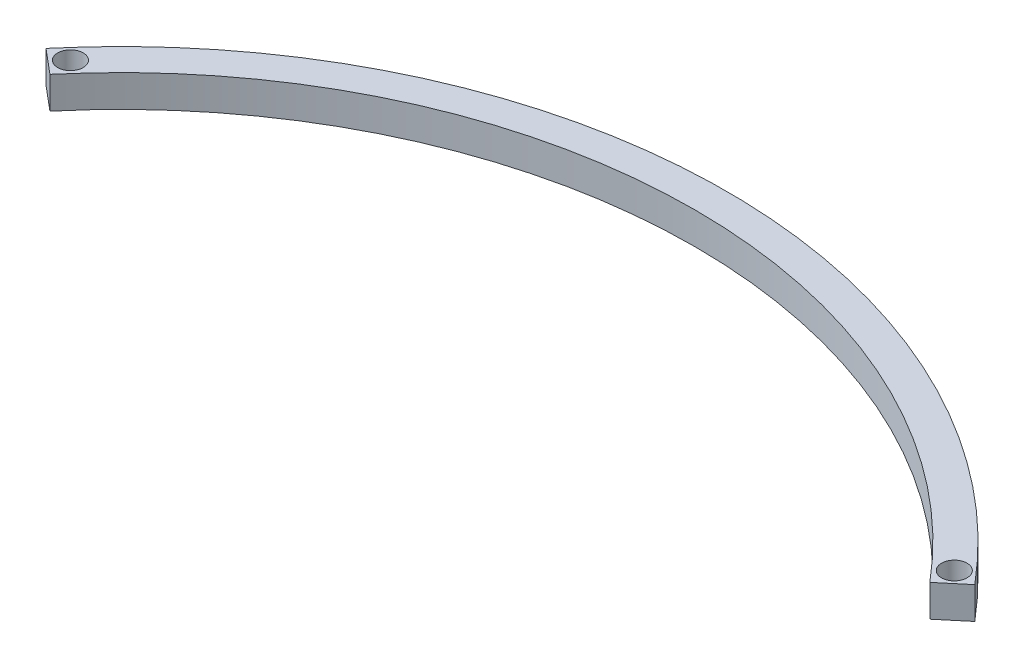
ISO-10303-21;
HEADER;
FILE_DESCRIPTION(('STEP AP214'),'2;1');
FILE_NAME('part.step','',(''),(''),'','','');
FILE_SCHEMA(('AUTOMOTIVE_DESIGN { 1 0 10303 214 1 1 1 1 }'));
ENDSEC;
DATA;
#1=APPLICATION_CONTEXT('core data for automotive mechanical design processes');
#2=APPLICATION_PROTOCOL_DEFINITION('international standard','automotive_design',2000,#1);
#3=PRODUCT_CONTEXT('',#1,'mechanical');
#4=PRODUCT('Part','Part','',(#3));
#5=PRODUCT_RELATED_PRODUCT_CATEGORY('part','',(#4));
#6=PRODUCT_DEFINITION_FORMATION('','',#4);
#7=PRODUCT_DEFINITION_CONTEXT('part definition',#1,'design');
#8=PRODUCT_DEFINITION('design','',#6,#7);
#9=PRODUCT_DEFINITION_SHAPE('','',#8);
#10=(LENGTH_UNIT() NAMED_UNIT(*) SI_UNIT(.MILLI.,.METRE.));
#11=(NAMED_UNIT(*) PLANE_ANGLE_UNIT() SI_UNIT($,.RADIAN.));
#12=(NAMED_UNIT(*) SI_UNIT($,.STERADIAN.) SOLID_ANGLE_UNIT());
#13=UNCERTAINTY_MEASURE_WITH_UNIT(LENGTH_MEASURE(1.E-05),#10,'distance_accuracy_value','');
#14=(GEOMETRIC_REPRESENTATION_CONTEXT(3) GLOBAL_UNCERTAINTY_ASSIGNED_CONTEXT((#13)) GLOBAL_UNIT_ASSIGNED_CONTEXT((#10,
#11,#12)) REPRESENTATION_CONTEXT('',''));
#15=CARTESIAN_POINT('',(0.,0.,0.));
#16=DIRECTION('',(0.,0.,1.));
#17=DIRECTION('',(1.,0.,0.));
#18=AXIS2_PLACEMENT_3D('',#15,#16,#17);
#19=CARTESIAN_POINT('',(0.,5.,0.));
#20=DIRECTION('',(0.,-1.,0.));
#21=DIRECTION('',(0.,0.,-1.));
#22=AXIS2_PLACEMENT_3D('',#19,#20,#21);
#23=PLANE('',#22);
#24=CARTESIAN_POINT('',(0.,5.,0.));
#25=DIRECTION('',(0.,1.,0.));
#26=DIRECTION('',(0.,0.,-1.));
#27=AXIS2_PLACEMENT_3D('',#24,#25,#26);
#28=CIRCLE('',#27,190.);
#29=CARTESIAN_POINT('',(145.548444192606,5.,-122.129645840443));
#30=VERTEX_POINT('',#29);
#31=CARTESIAN_POINT('',(-145.548444192606,5.,-122.129645840443));
#32=VERTEX_POINT('',#31);
#33=EDGE_CURVE('E96',#30,#32,#28,.T.);
#34=ORIENTED_EDGE('',*,*,#33,.T.);
#35=DIRECTION('',(0.766044443118977,0.,0.642787609686541));
#36=VECTOR('',#35,1.);
#37=CARTESIAN_POINT('',(-145.548444192606,5.,-122.129645840443));
#38=LINE('',#37,#36);
#39=CARTESIAN_POINT('',(-137.887999761416,5.,-115.701769743577));
#40=VERTEX_POINT('',#39);
#41=EDGE_CURVE('E91',#32,#40,#38,.T.);
#42=ORIENTED_EDGE('',*,*,#41,.T.);
#43=CARTESIAN_POINT('',(0.,5.,0.));
#44=DIRECTION('',(0.,-1.,0.));
#45=DIRECTION('',(0.,0.,-1.));
#46=AXIS2_PLACEMENT_3D('',#43,#44,#45);
#47=CIRCLE('',#46,180.);
#48=CARTESIAN_POINT('',(137.887999761416,5.,-115.701769743577));
#49=VERTEX_POINT('',#48);
#50=EDGE_CURVE('E94',#40,#49,#47,.T.);
#51=ORIENTED_EDGE('',*,*,#50,.T.);
#52=DIRECTION('',(0.766044443118975,0.,-0.642787609686543));
#53=VECTOR('',#52,1.);
#54=CARTESIAN_POINT('',(145.548444192606,5.,-122.129645840443));
#55=LINE('',#54,#53);
#56=EDGE_CURVE('E61',#49,#30,#55,.T.);
#57=ORIENTED_EDGE('',*,*,#56,.T.);
#58=EDGE_LOOP('',(#34,#42,#51,#57));
#59=FACE_BOUND('',#58,.T.);
#60=CARTESIAN_POINT('',(-138.504283928578,5.,-122.745930007605));
#61=DIRECTION('',(0.,1.,0.));
#62=DIRECTION('',(0.,0.,1.));
#63=AXIS2_PLACEMENT_3D('',#60,#61,#62);
#64=CIRCLE('',#63,3.99999999999999);
#65=CARTESIAN_POINT('',(-138.504283928578,5.,-118.745930007605));
#66=VERTEX_POINT('',#65);
#67=EDGE_CURVE('E116',#66,#66,#64,.T.);
#68=ORIENTED_EDGE('',*,*,#67,.F.);
#69=EDGE_LOOP('',(#68));
#70=FACE_BOUND('',#69,.T.);
#71=CARTESIAN_POINT('',(138.504283928578,5.,-122.745930007605));
#72=DIRECTION('',(0.,1.,0.));
#73=DIRECTION('',(0.,0.,-1.));
#74=AXIS2_PLACEMENT_3D('',#71,#72,#73);
#75=CIRCLE('',#74,3.99999999999999);
#76=CARTESIAN_POINT('',(138.504283928578,5.,-126.745930007605));
#77=VERTEX_POINT('',#76);
#78=EDGE_CURVE('E138',#77,#77,#75,.T.);
#79=ORIENTED_EDGE('',*,*,#78,.F.);
#80=EDGE_LOOP('',(#79));
#81=FACE_BOUND('',#80,.T.);
#82=ADVANCED_FACE('F43',(#59,#70,#81),#23,.F.);
#83=CARTESIAN_POINT('',(0.,-5.,0.));
#84=DIRECTION('',(0.,-1.,0.));
#85=DIRECTION('',(0.,0.,-1.));
#86=AXIS2_PLACEMENT_3D('',#83,#84,#85);
#87=PLANE('',#86);
#88=CARTESIAN_POINT('',(-138.504283928578,-5.,-122.745930007605));
#89=DIRECTION('',(0.,1.,0.));
#90=DIRECTION('',(0.,0.,1.));
#91=AXIS2_PLACEMENT_3D('',#88,#89,#90);
#92=CIRCLE('',#91,3.99999999999999);
#93=CARTESIAN_POINT('',(-138.504283928578,-5.,-118.745930007605));
#94=VERTEX_POINT('',#93);
#95=EDGE_CURVE('E134',#94,#94,#92,.T.);
#96=ORIENTED_EDGE('',*,*,#95,.T.);
#97=EDGE_LOOP('',(#96));
#98=FACE_BOUND('',#97,.T.);
#99=CARTESIAN_POINT('',(0.,-5.,0.));
#100=DIRECTION('',(0.,1.,0.));
#101=DIRECTION('',(0.,0.,-1.));
#102=AXIS2_PLACEMENT_3D('',#99,#100,#101);
#103=CIRCLE('',#102,190.);
#104=CARTESIAN_POINT('',(145.548444192606,-5.,-122.129645840443));
#105=VERTEX_POINT('',#104);
#106=CARTESIAN_POINT('',(-145.548444192606,-5.,-122.129645840443));
#107=VERTEX_POINT('',#106);
#108=EDGE_CURVE('E112',#105,#107,#103,.T.);
#109=ORIENTED_EDGE('',*,*,#108,.F.);
#110=DIRECTION('',(0.766044443118975,0.,-0.642787609686543));
#111=VECTOR('',#110,1.);
#112=CARTESIAN_POINT('',(145.548444192606,-5.,-122.129645840443));
#113=LINE('',#112,#111);
#114=CARTESIAN_POINT('',(137.887999761416,-5.,-115.701769743577));
#115=VERTEX_POINT('',#114);
#116=EDGE_CURVE('E84',#115,#105,#113,.T.);
#117=ORIENTED_EDGE('',*,*,#116,.F.);
#118=CARTESIAN_POINT('',(0.,-5.,0.));
#119=DIRECTION('',(0.,-1.,0.));
#120=DIRECTION('',(0.,0.,-1.));
#121=AXIS2_PLACEMENT_3D('',#118,#119,#120);
#122=CIRCLE('',#121,180.);
#123=CARTESIAN_POINT('',(-137.887999761416,-5.,-115.701769743577));
#124=VERTEX_POINT('',#123);
#125=EDGE_CURVE('E78',#124,#115,#122,.T.);
#126=ORIENTED_EDGE('',*,*,#125,.F.);
#127=DIRECTION('',(0.766044443118977,0.,0.642787609686541));
#128=VECTOR('',#127,1.);
#129=CARTESIAN_POINT('',(-145.548444192606,-5.,-122.129645840443));
#130=LINE('',#129,#128);
#131=EDGE_CURVE('E101',#107,#124,#130,.T.);
#132=ORIENTED_EDGE('',*,*,#131,.F.);
#133=EDGE_LOOP('',(#109,#117,#126,#132));
#134=FACE_BOUND('',#133,.T.);
#135=CARTESIAN_POINT('',(138.504283928578,-5.,-122.745930007605));
#136=DIRECTION('',(0.,1.,0.));
#137=DIRECTION('',(0.,0.,-1.));
#138=AXIS2_PLACEMENT_3D('',#135,#136,#137);
#139=CIRCLE('',#138,3.99999999999999);
#140=CARTESIAN_POINT('',(138.504283928578,-5.,-126.745930007605));
#141=VERTEX_POINT('',#140);
#142=EDGE_CURVE('E142',#141,#141,#139,.T.);
#143=ORIENTED_EDGE('',*,*,#142,.T.);
#144=EDGE_LOOP('',(#143));
#145=FACE_BOUND('',#144,.T.);
#146=ADVANCED_FACE('F129',(#98,#134,#145),#87,.T.);
#147=CARTESIAN_POINT('',(0.,5.,0.));
#148=DIRECTION('',(0.,-1.,0.));
#149=DIRECTION('',(0.,0.,-1.));
#150=AXIS2_PLACEMENT_3D('',#147,#148,#149);
#151=CYLINDRICAL_SURFACE('',#150,190.);
#152=ORIENTED_EDGE('',*,*,#108,.T.);
#153=DIRECTION('',(0.,-1.,0.));
#154=VECTOR('',#153,1.);
#155=CARTESIAN_POINT('',(-145.548444192606,5.,-122.129645840443));
#156=LINE('',#155,#154);
#157=EDGE_CURVE('E11',#32,#107,#156,.T.);
#158=ORIENTED_EDGE('',*,*,#157,.F.);
#159=ORIENTED_EDGE('',*,*,#33,.F.);
#160=DIRECTION('',(0.,-1.,0.));
#161=VECTOR('',#160,1.);
#162=CARTESIAN_POINT('',(145.548444192606,5.,-122.129645840443));
#163=LINE('',#162,#161);
#164=EDGE_CURVE('E108',#30,#105,#163,.T.);
#165=ORIENTED_EDGE('',*,*,#164,.T.);
#166=EDGE_LOOP('',(#152,#158,#159,#165));
#167=FACE_BOUND('',#166,.T.);
#168=ADVANCED_FACE('F45',(#167),#151,.T.);
#169=CARTESIAN_POINT('',(-145.548444192606,5.,-122.129645840443));
#170=DIRECTION('',(0.642787609686541,0.,-0.766044443118977));
#171=DIRECTION('',(-0.766044443118977,0.,-0.642787609686541));
#172=AXIS2_PLACEMENT_3D('',#169,#170,#171);
#173=PLANE('',#172);
#174=ORIENTED_EDGE('',*,*,#131,.T.);
#175=DIRECTION('',(0.,-1.,0.));
#176=VECTOR('',#175,1.);
#177=CARTESIAN_POINT('',(-137.887999761416,5.,-115.701769743577));
#178=LINE('',#177,#176);
#179=EDGE_CURVE('E53',#40,#124,#178,.T.);
#180=ORIENTED_EDGE('',*,*,#179,.F.);
#181=ORIENTED_EDGE('',*,*,#41,.F.);
#182=ORIENTED_EDGE('',*,*,#157,.T.);
#183=EDGE_LOOP('',(#174,#180,#181,#182));
#184=FACE_BOUND('',#183,.T.);
#185=ADVANCED_FACE('F100',(#184),#173,.F.);
#186=CARTESIAN_POINT('',(0.,5.,0.));
#187=DIRECTION('',(0.,-1.,0.));
#188=DIRECTION('',(0.,0.,-1.));
#189=AXIS2_PLACEMENT_3D('',#186,#187,#188);
#190=CYLINDRICAL_SURFACE('',#189,180.);
#191=ORIENTED_EDGE('',*,*,#125,.T.);
#192=DIRECTION('',(0.,-1.,0.));
#193=VECTOR('',#192,1.);
#194=CARTESIAN_POINT('',(137.887999761416,5.,-115.701769743577));
#195=LINE('',#194,#193);
#196=EDGE_CURVE('E103',#49,#115,#195,.T.);
#197=ORIENTED_EDGE('',*,*,#196,.F.);
#198=ORIENTED_EDGE('',*,*,#50,.F.);
#199=ORIENTED_EDGE('',*,*,#179,.T.);
#200=EDGE_LOOP('',(#191,#197,#198,#199));
#201=FACE_BOUND('',#200,.T.);
#202=ADVANCED_FACE('F104',(#201),#190,.F.);
#203=CARTESIAN_POINT('',(145.548444192606,5.,-122.129645840443));
#204=DIRECTION('',(-0.642787609686543,0.,-0.766044443118975));
#205=DIRECTION('',(-0.766044443118975,0.,0.642787609686543));
#206=AXIS2_PLACEMENT_3D('',#203,#204,#205);
#207=PLANE('',#206);
#208=ORIENTED_EDGE('',*,*,#116,.T.);
#209=ORIENTED_EDGE('',*,*,#164,.F.);
#210=ORIENTED_EDGE('',*,*,#56,.F.);
#211=ORIENTED_EDGE('',*,*,#196,.T.);
#212=EDGE_LOOP('',(#208,#209,#210,#211));
#213=FACE_BOUND('',#212,.T.);
#214=ADVANCED_FACE('F126',(#213),#207,.F.);
#215=CARTESIAN_POINT('',(-138.504283928578,5.,-122.745930007605));
#216=DIRECTION('',(0.,-1.,0.));
#217=DIRECTION('',(0.,0.,-1.));
#218=AXIS2_PLACEMENT_3D('',#215,#216,#217);
#219=CYLINDRICAL_SURFACE('',#218,3.99999999999999);
#220=ORIENTED_EDGE('',*,*,#67,.T.);
#221=EDGE_LOOP('',(#220));
#222=FACE_BOUND('',#221,.T.);
#223=ORIENTED_EDGE('',*,*,#95,.F.);
#224=EDGE_LOOP('',(#223));
#225=FACE_BOUND('',#224,.T.);
#226=ADVANCED_FACE('F161',(#222,#225),#219,.F.);
#227=CARTESIAN_POINT('',(138.504283928578,5.,-122.745930007605));
#228=DIRECTION('',(0.,-1.,0.));
#229=DIRECTION('',(0.,0.,-1.));
#230=AXIS2_PLACEMENT_3D('',#227,#228,#229);
#231=CYLINDRICAL_SURFACE('',#230,3.99999999999999);
#232=ORIENTED_EDGE('',*,*,#78,.T.);
#233=EDGE_LOOP('',(#232));
#234=FACE_BOUND('',#233,.T.);
#235=ORIENTED_EDGE('',*,*,#142,.F.);
#236=EDGE_LOOP('',(#235));
#237=FACE_BOUND('',#236,.T.);
#238=ADVANCED_FACE('F150',(#234,#237),#231,.F.);
#239=CLOSED_SHELL('',(#82,#146,#168,#185,#202,#214,#226,#238));
#240=MANIFOLD_SOLID_BREP('B2',#239);
#241=ADVANCED_BREP_SHAPE_REPRESENTATION('',(#18,#240),#14);
#242=SHAPE_DEFINITION_REPRESENTATION(#9,#241);
ENDSEC;
END-ISO-10303-21;
